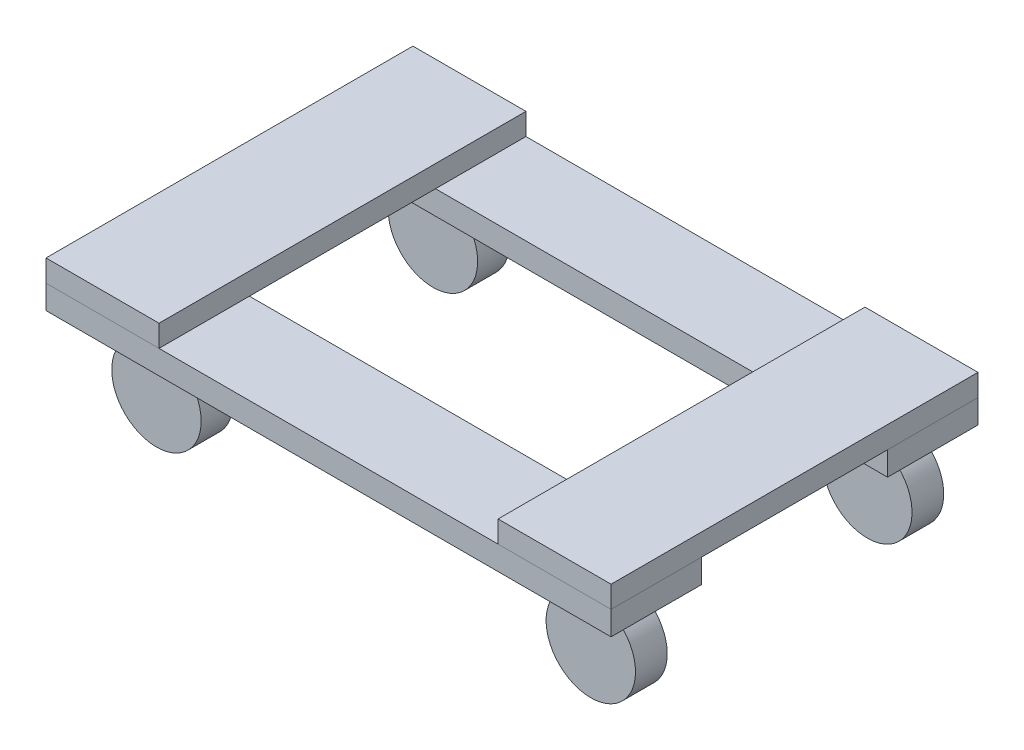
ISO-10303-21;
HEADER;
FILE_DESCRIPTION(('STEP AP214'),'2;1');
FILE_NAME('part.step','',(''),(''),'','','');
FILE_SCHEMA(('AUTOMOTIVE_DESIGN { 1 0 10303 214 1 1 1 1 }'));
ENDSEC;
DATA;
#1=APPLICATION_CONTEXT('core data for automotive mechanical design processes');
#2=APPLICATION_PROTOCOL_DEFINITION('international standard','automotive_design',2000,#1);
#3=PRODUCT_CONTEXT('',#1,'mechanical');
#4=PRODUCT('Part','Part','',(#3));
#5=PRODUCT_RELATED_PRODUCT_CATEGORY('part','',(#4));
#6=PRODUCT_DEFINITION_FORMATION('','',#4);
#7=PRODUCT_DEFINITION_CONTEXT('part definition',#1,'design');
#8=PRODUCT_DEFINITION('design','',#6,#7);
#9=PRODUCT_DEFINITION_SHAPE('','',#8);
#10=(LENGTH_UNIT() NAMED_UNIT(*) SI_UNIT(.MILLI.,.METRE.));
#11=(NAMED_UNIT(*) PLANE_ANGLE_UNIT() SI_UNIT($,.RADIAN.));
#12=(NAMED_UNIT(*) SI_UNIT($,.STERADIAN.) SOLID_ANGLE_UNIT());
#13=UNCERTAINTY_MEASURE_WITH_UNIT(LENGTH_MEASURE(1.E-05),#10,'distance_accuracy_value','');
#14=(GEOMETRIC_REPRESENTATION_CONTEXT(3) GLOBAL_UNCERTAINTY_ASSIGNED_CONTEXT((#13)) GLOBAL_UNIT_ASSIGNED_CONTEXT((#10,
#11,#12)) REPRESENTATION_CONTEXT('',''));
#15=CARTESIAN_POINT('',(0.,0.,0.));
#16=DIRECTION('',(0.,0.,1.));
#17=DIRECTION('',(1.,0.,0.));
#18=AXIS2_PLACEMENT_3D('',#15,#16,#17);
#19=CARTESIAN_POINT('',(412.709416413009,-38.0904165391627,-23.495));
#20=DIRECTION('',(0.,0.,-1.));
#21=DIRECTION('',(-1.,0.,0.));
#22=AXIS2_PLACEMENT_3D('',#19,#20,#21);
#23=CYLINDRICAL_SURFACE('',#22,35.7892438983898);
#24=CARTESIAN_POINT('',(412.709416413009,-38.0904165391627,-23.495));
#25=DIRECTION('',(0.,0.,-1.));
#26=DIRECTION('',(-1.,0.,0.));
#27=AXIS2_PLACEMENT_3D('',#24,#25,#26);
#28=CIRCLE('',#27,35.7892438983898);
#29=CARTESIAN_POINT('',(376.920172514619,-38.0904165391627,-23.495));
#30=VERTEX_POINT('',#29);
#31=EDGE_CURVE('E11',#30,#30,#28,.T.);
#32=ORIENTED_EDGE('',*,*,#31,.T.);
#33=EDGE_LOOP('',(#32));
#34=FACE_BOUND('',#33,.T.);
#35=CARTESIAN_POINT('',(412.709416413009,-38.0904165391627,-48.895));
#36=DIRECTION('',(0.,0.,-1.));
#37=DIRECTION('',(-1.,0.,0.));
#38=AXIS2_PLACEMENT_3D('',#35,#36,#37);
#39=CIRCLE('',#38,35.7892438983898);
#40=CARTESIAN_POINT('',(376.920172514619,-38.0904165391627,-48.895));
#41=VERTEX_POINT('',#40);
#42=EDGE_CURVE('E49',#41,#41,#39,.T.);
#43=ORIENTED_EDGE('',*,*,#42,.F.);
#44=EDGE_LOOP('',(#43));
#45=FACE_BOUND('',#44,.T.);
#46=ADVANCED_FACE('F43',(#34,#45),#23,.T.);
#47=CARTESIAN_POINT('',(412.709416413009,-38.0904165391627,-23.495));
#48=DIRECTION('',(0.,0.,-1.));
#49=DIRECTION('',(-1.,0.,0.));
#50=AXIS2_PLACEMENT_3D('',#47,#48,#49);
#51=PLANE('',#50);
#52=ORIENTED_EDGE('',*,*,#31,.F.);
#53=EDGE_LOOP('',(#52));
#54=FACE_BOUND('',#53,.T.);
#55=ADVANCED_FACE('F58',(#54),#51,.F.);
#56=CARTESIAN_POINT('',(412.709416413009,-38.0904165391627,-48.895));
#57=DIRECTION('',(0.,0.,-1.));
#58=DIRECTION('',(-1.,0.,0.));
#59=AXIS2_PLACEMENT_3D('',#56,#57,#58);
#60=PLANE('',#59);
#61=ORIENTED_EDGE('',*,*,#42,.T.);
#62=EDGE_LOOP('',(#61));
#63=FACE_BOUND('',#62,.T.);
#64=ADVANCED_FACE('F55',(#63),#60,.T.);
#65=CLOSED_SHELL('',(#46,#55,#64));
#66=MANIFOLD_SOLID_BREP('B2',#65);
#67=CARTESIAN_POINT('',(64.9415667025721,-38.0904165391627,-23.495));
#68=DIRECTION('',(0.,0.,-1.));
#69=DIRECTION('',(-1.,0.,0.));
#70=AXIS2_PLACEMENT_3D('',#67,#68,#69);
#71=CYLINDRICAL_SURFACE('',#70,35.7892438983898);
#72=CARTESIAN_POINT('',(64.9415667025721,-38.0904165391627,-23.495));
#73=DIRECTION('',(0.,0.,-1.));
#74=DIRECTION('',(-1.,0.,0.));
#75=AXIS2_PLACEMENT_3D('',#72,#73,#74);
#76=CIRCLE('',#75,35.7892438983898);
#77=CARTESIAN_POINT('',(29.1523228041823,-38.0904165391627,-23.495));
#78=VERTEX_POINT('',#77);
#79=EDGE_CURVE('E42',#78,#78,#76,.T.);
#80=ORIENTED_EDGE('',*,*,#79,.T.);
#81=EDGE_LOOP('',(#80));
#82=FACE_BOUND('',#81,.T.);
#83=CARTESIAN_POINT('',(64.9415667025721,-38.0904165391627,-48.895));
#84=DIRECTION('',(0.,0.,-1.));
#85=DIRECTION('',(-1.,0.,0.));
#86=AXIS2_PLACEMENT_3D('',#83,#84,#85);
#87=CIRCLE('',#86,35.7892438983898);
#88=CARTESIAN_POINT('',(29.1523228041823,-38.0904165391627,-48.895));
#89=VERTEX_POINT('',#88);
#90=EDGE_CURVE('E97',#89,#89,#87,.T.);
#91=ORIENTED_EDGE('',*,*,#90,.F.);
#92=EDGE_LOOP('',(#91));
#93=FACE_BOUND('',#92,.T.);
#94=ADVANCED_FACE('F91',(#82,#93),#71,.T.);
#95=CARTESIAN_POINT('',(64.9415667025721,-38.0904165391627,-23.495));
#96=DIRECTION('',(0.,0.,-1.));
#97=DIRECTION('',(-1.,0.,0.));
#98=AXIS2_PLACEMENT_3D('',#95,#96,#97);
#99=PLANE('',#98);
#100=ORIENTED_EDGE('',*,*,#79,.F.);
#101=EDGE_LOOP('',(#100));
#102=FACE_BOUND('',#101,.T.);
#103=ADVANCED_FACE('F106',(#102),#99,.F.);
#104=CARTESIAN_POINT('',(64.9415667025721,-38.0904165391627,-48.895));
#105=DIRECTION('',(0.,0.,-1.));
#106=DIRECTION('',(-1.,0.,0.));
#107=AXIS2_PLACEMENT_3D('',#104,#105,#106);
#108=PLANE('',#107);
#109=ORIENTED_EDGE('',*,*,#90,.T.);
#110=EDGE_LOOP('',(#109));
#111=FACE_BOUND('',#110,.T.);
#112=ADVANCED_FACE('F103',(#111),#108,.T.);
#113=CLOSED_SHELL('',(#94,#103,#112));
#114=MANIFOLD_SOLID_BREP('B6',#113);
#115=CARTESIAN_POINT('',(412.709416413009,-38.0904165391627,172.496971524493));
#116=DIRECTION('',(0.,0.,1.));
#117=DIRECTION('',(1.,0.,0.));
#118=AXIS2_PLACEMENT_3D('',#115,#116,#117);
#119=CYLINDRICAL_SURFACE('',#118,35.7892438983898);
#120=CARTESIAN_POINT('',(412.709416413009,-38.0904165391627,172.496971524493));
#121=DIRECTION('',(0.,0.,1.));
#122=DIRECTION('',(1.,0.,0.));
#123=AXIS2_PLACEMENT_3D('',#120,#121,#122);
#124=CIRCLE('',#123,35.7892438983898);
#125=CARTESIAN_POINT('',(448.498660311398,-38.0904165391627,172.496971524493));
#126=VERTEX_POINT('',#125);
#127=EDGE_CURVE('E90',#126,#126,#124,.T.);
#128=ORIENTED_EDGE('',*,*,#127,.T.);
#129=EDGE_LOOP('',(#128));
#130=FACE_BOUND('',#129,.T.);
#131=CARTESIAN_POINT('',(412.709416413009,-38.0904165391627,197.896971524493));
#132=DIRECTION('',(0.,0.,1.));
#133=DIRECTION('',(1.,0.,0.));
#134=AXIS2_PLACEMENT_3D('',#131,#132,#133);
#135=CIRCLE('',#134,35.7892438983898);
#136=CARTESIAN_POINT('',(448.498660311398,-38.0904165391627,197.896971524493));
#137=VERTEX_POINT('',#136);
#138=EDGE_CURVE('E146',#137,#137,#135,.T.);
#139=ORIENTED_EDGE('',*,*,#138,.F.);
#140=EDGE_LOOP('',(#139));
#141=FACE_BOUND('',#140,.T.);
#142=ADVANCED_FACE('F139',(#130,#141),#119,.T.);
#143=CARTESIAN_POINT('',(412.709416413009,-38.0904165391627,172.496971524493));
#144=DIRECTION('',(0.,0.,1.));
#145=DIRECTION('',(1.,0.,0.));
#146=AXIS2_PLACEMENT_3D('',#143,#144,#145);
#147=PLANE('',#146);
#148=ORIENTED_EDGE('',*,*,#127,.F.);
#149=EDGE_LOOP('',(#148));
#150=FACE_BOUND('',#149,.T.);
#151=ADVANCED_FACE('F156',(#150),#147,.F.);
#152=CARTESIAN_POINT('',(412.709416413009,-38.0904165391627,197.896971524493));
#153=DIRECTION('',(0.,0.,1.));
#154=DIRECTION('',(1.,0.,0.));
#155=AXIS2_PLACEMENT_3D('',#152,#153,#154);
#156=PLANE('',#155);
#157=ORIENTED_EDGE('',*,*,#138,.T.);
#158=EDGE_LOOP('',(#157));
#159=FACE_BOUND('',#158,.T.);
#160=ADVANCED_FACE('F153',(#159),#156,.T.);
#161=CLOSED_SHELL('',(#142,#151,#160));
#162=MANIFOLD_SOLID_BREP('B37',#161);
#163=CARTESIAN_POINT('',(64.9415667025721,-38.0904165391627,172.496971524493));
#164=DIRECTION('',(0.,0.,1.));
#165=DIRECTION('',(1.,0.,0.));
#166=AXIS2_PLACEMENT_3D('',#163,#164,#165);
#167=CYLINDRICAL_SURFACE('',#166,35.7892438983898);
#168=CARTESIAN_POINT('',(64.9415667025721,-38.0904165391627,172.496971524493));
#169=DIRECTION('',(0.,0.,1.));
#170=DIRECTION('',(1.,0.,0.));
#171=AXIS2_PLACEMENT_3D('',#168,#169,#170);
#172=CIRCLE('',#171,35.7892438983898);
#173=CARTESIAN_POINT('',(100.730810600962,-38.0904165391627,172.496971524493));
#174=VERTEX_POINT('',#173);
#175=EDGE_CURVE('E138',#174,#174,#172,.T.);
#176=ORIENTED_EDGE('',*,*,#175,.T.);
#177=EDGE_LOOP('',(#176));
#178=FACE_BOUND('',#177,.T.);
#179=CARTESIAN_POINT('',(64.9415667025721,-38.0904165391627,197.896971524493));
#180=DIRECTION('',(0.,0.,1.));
#181=DIRECTION('',(1.,0.,0.));
#182=AXIS2_PLACEMENT_3D('',#179,#180,#181);
#183=CIRCLE('',#182,35.7892438983898);
#184=CARTESIAN_POINT('',(100.730810600962,-38.0904165391627,197.896971524493));
#185=VERTEX_POINT('',#184);
#186=EDGE_CURVE('E197',#185,#185,#183,.T.);
#187=ORIENTED_EDGE('',*,*,#186,.F.);
#188=EDGE_LOOP('',(#187));
#189=FACE_BOUND('',#188,.T.);
#190=ADVANCED_FACE('F191',(#178,#189),#167,.T.);
#191=CARTESIAN_POINT('',(64.9415667025721,-38.0904165391627,172.496971524493));
#192=DIRECTION('',(0.,0.,1.));
#193=DIRECTION('',(1.,0.,0.));
#194=AXIS2_PLACEMENT_3D('',#191,#192,#193);
#195=PLANE('',#194);
#196=ORIENTED_EDGE('',*,*,#175,.F.);
#197=EDGE_LOOP('',(#196));
#198=FACE_BOUND('',#197,.T.);
#199=ADVANCED_FACE('F206',(#198),#195,.F.);
#200=CARTESIAN_POINT('',(64.9415667025721,-38.0904165391627,197.896971524493));
#201=DIRECTION('',(0.,0.,1.));
#202=DIRECTION('',(1.,0.,0.));
#203=AXIS2_PLACEMENT_3D('',#200,#201,#202);
#204=PLANE('',#203);
#205=ORIENTED_EDGE('',*,*,#186,.T.);
#206=EDGE_LOOP('',(#205));
#207=FACE_BOUND('',#206,.T.);
#208=ADVANCED_FACE('F203',(#207),#204,.T.);
#209=CLOSED_SHELL('',(#190,#199,#208));
#210=MANIFOLD_SOLID_BREP('B85',#209);
#211=CARTESIAN_POINT('',(0.,36.5125,221.391971524493));
#212=DIRECTION('',(1.,0.,0.));
#213=DIRECTION('',(0.,0.,-1.));
#214=AXIS2_PLACEMENT_3D('',#211,#212,#213);
#215=PLANE('',#214);
#216=DIRECTION('',(0.,0.,1.));
#217=VECTOR('',#216,1.);
#218=CARTESIAN_POINT('',(0.,19.05,221.391971524493));
#219=LINE('',#218,#217);
#220=CARTESIAN_POINT('',(0.,19.05,-72.39));
#221=VERTEX_POINT('',#220);
#222=CARTESIAN_POINT('',(0.,19.05,221.391971524493));
#223=VERTEX_POINT('',#222);
#224=EDGE_CURVE('E304',#221,#223,#219,.T.);
#225=ORIENTED_EDGE('',*,*,#224,.T.);
#226=DIRECTION('',(0.,-1.,0.));
#227=VECTOR('',#226,1.);
#228=CARTESIAN_POINT('',(0.,36.5125,221.391971524493));
#229=LINE('',#228,#227);
#230=CARTESIAN_POINT('',(0.,36.5125,221.391971524493));
#231=VERTEX_POINT('',#230);
#232=EDGE_CURVE('E189',#231,#223,#229,.T.);
#233=ORIENTED_EDGE('',*,*,#232,.F.);
#234=DIRECTION('',(0.,0.,1.));
#235=VECTOR('',#234,1.);
#236=CARTESIAN_POINT('',(0.,36.5125,221.391971524493));
#237=LINE('',#236,#235);
#238=CARTESIAN_POINT('',(0.,36.5125,-72.39));
#239=VERTEX_POINT('',#238);
#240=EDGE_CURVE('E292',#239,#231,#237,.T.);
#241=ORIENTED_EDGE('',*,*,#240,.F.);
#242=DIRECTION('',(0.,-1.,0.));
#243=VECTOR('',#242,1.);
#244=CARTESIAN_POINT('',(0.,36.5125,-72.39));
#245=LINE('',#244,#243);
#246=EDGE_CURVE('E300',#239,#221,#245,.T.);
#247=ORIENTED_EDGE('',*,*,#246,.T.);
#248=EDGE_LOOP('',(#225,#233,#241,#247));
#249=FACE_BOUND('',#248,.T.);
#250=ADVANCED_FACE('F241',(#249),#215,.F.);
#251=CARTESIAN_POINT('',(0.,36.5125,221.391971524493));
#252=DIRECTION('',(0.,0.,-1.));
#253=DIRECTION('',(-1.,0.,0.));
#254=AXIS2_PLACEMENT_3D('',#251,#252,#253);
#255=PLANE('',#254);
#256=DIRECTION('',(1.,0.,0.));
#257=VECTOR('',#256,1.);
#258=CARTESIAN_POINT('',(0.,19.05,221.391971524493));
#259=LINE('',#258,#257);
#260=CARTESIAN_POINT('',(90.4875,19.05,221.391971524493));
#261=VERTEX_POINT('',#260);
#262=EDGE_CURVE('E296',#223,#261,#259,.T.);
#263=ORIENTED_EDGE('',*,*,#262,.T.);
#264=DIRECTION('',(0.,-1.,0.));
#265=VECTOR('',#264,1.);
#266=CARTESIAN_POINT('',(90.4875,36.5125,221.391971524493));
#267=LINE('',#266,#265);
#268=CARTESIAN_POINT('',(90.4875,36.5125,221.391971524493));
#269=VERTEX_POINT('',#268);
#270=EDGE_CURVE('E249',#269,#261,#267,.T.);
#271=ORIENTED_EDGE('',*,*,#270,.F.);
#272=DIRECTION('',(1.,0.,0.));
#273=VECTOR('',#272,1.);
#274=CARTESIAN_POINT('',(0.,36.5125,221.391971524493));
#275=LINE('',#274,#273);
#276=EDGE_CURVE('E287',#231,#269,#275,.T.);
#277=ORIENTED_EDGE('',*,*,#276,.F.);
#278=ORIENTED_EDGE('',*,*,#232,.T.);
#279=EDGE_LOOP('',(#263,#271,#277,#278));
#280=FACE_BOUND('',#279,.T.);
#281=ADVANCED_FACE('F295',(#280),#255,.F.);
#282=CARTESIAN_POINT('',(90.4875,36.5125,221.391971524493));
#283=DIRECTION('',(-1.,0.,0.));
#284=DIRECTION('',(0.,0.,1.));
#285=AXIS2_PLACEMENT_3D('',#282,#283,#284);
#286=PLANE('',#285);
#287=DIRECTION('',(0.,0.,-1.));
#288=VECTOR('',#287,1.);
#289=CARTESIAN_POINT('',(90.4875,19.05,221.391971524493));
#290=LINE('',#289,#288);
#291=CARTESIAN_POINT('',(90.4875,19.05,-72.39));
#292=VERTEX_POINT('',#291);
#293=EDGE_CURVE('E274',#261,#292,#290,.T.);
#294=ORIENTED_EDGE('',*,*,#293,.T.);
#295=DIRECTION('',(0.,-1.,0.));
#296=VECTOR('',#295,1.);
#297=CARTESIAN_POINT('',(90.4875,36.5125,-72.39));
#298=LINE('',#297,#296);
#299=CARTESIAN_POINT('',(90.4875,36.5125,-72.39));
#300=VERTEX_POINT('',#299);
#301=EDGE_CURVE('E297',#300,#292,#298,.T.);
#302=ORIENTED_EDGE('',*,*,#301,.F.);
#303=DIRECTION('',(0.,0.,-1.));
#304=VECTOR('',#303,1.);
#305=CARTESIAN_POINT('',(90.4875,36.5125,221.391971524493));
#306=LINE('',#305,#304);
#307=EDGE_CURVE('E290',#269,#300,#306,.T.);
#308=ORIENTED_EDGE('',*,*,#307,.F.);
#309=ORIENTED_EDGE('',*,*,#270,.T.);
#310=EDGE_LOOP('',(#294,#302,#308,#309));
#311=FACE_BOUND('',#310,.T.);
#312=ADVANCED_FACE('F298',(#311),#286,.F.);
#313=CARTESIAN_POINT('',(0.,36.5125,-72.39));
#314=DIRECTION('',(0.,0.,1.));
#315=DIRECTION('',(1.,0.,0.));
#316=AXIS2_PLACEMENT_3D('',#313,#314,#315);
#317=PLANE('',#316);
#318=DIRECTION('',(-1.,0.,0.));
#319=VECTOR('',#318,1.);
#320=CARTESIAN_POINT('',(0.,19.05,-72.39));
#321=LINE('',#320,#319);
#322=EDGE_CURVE('E280',#292,#221,#321,.T.);
#323=ORIENTED_EDGE('',*,*,#322,.T.);
#324=ORIENTED_EDGE('',*,*,#246,.F.);
#325=DIRECTION('',(-1.,0.,0.));
#326=VECTOR('',#325,1.);
#327=CARTESIAN_POINT('',(0.,36.5125,-72.39));
#328=LINE('',#327,#326);
#329=EDGE_CURVE('E257',#300,#239,#328,.T.);
#330=ORIENTED_EDGE('',*,*,#329,.F.);
#331=ORIENTED_EDGE('',*,*,#301,.T.);
#332=EDGE_LOOP('',(#323,#324,#330,#331));
#333=FACE_BOUND('',#332,.T.);
#334=ADVANCED_FACE('F311',(#333),#317,.F.);
#335=CARTESIAN_POINT('',(0.,36.5125,0.));
#336=DIRECTION('',(0.,-1.,0.));
#337=DIRECTION('',(0.,0.,-1.));
#338=AXIS2_PLACEMENT_3D('',#335,#336,#337);
#339=PLANE('',#338);
#340=ORIENTED_EDGE('',*,*,#240,.T.);
#341=ORIENTED_EDGE('',*,*,#276,.T.);
#342=ORIENTED_EDGE('',*,*,#307,.T.);
#343=ORIENTED_EDGE('',*,*,#329,.T.);
#344=EDGE_LOOP('',(#340,#341,#342,#343));
#345=FACE_BOUND('',#344,.T.);
#346=ADVANCED_FACE('F288',(#345),#339,.F.);
#347=CARTESIAN_POINT('',(0.,19.05,0.));
#348=DIRECTION('',(0.,-1.,0.));
#349=DIRECTION('',(0.,0.,-1.));
#350=AXIS2_PLACEMENT_3D('',#347,#348,#349);
#351=PLANE('',#350);
#352=ORIENTED_EDGE('',*,*,#224,.F.);
#353=ORIENTED_EDGE('',*,*,#322,.F.);
#354=ORIENTED_EDGE('',*,*,#293,.F.);
#355=ORIENTED_EDGE('',*,*,#262,.F.);
#356=EDGE_LOOP('',(#352,#353,#354,#355));
#357=FACE_BOUND('',#356,.T.);
#358=ADVANCED_FACE('F314',(#357),#351,.T.);
#359=CLOSED_SHELL('',(#250,#281,#312,#334,#346,#358));
#360=MANIFOLD_SOLID_BREP('B133',#359);
#361=CARTESIAN_POINT('',(452.4375,36.5125,221.391971524493));
#362=DIRECTION('',(-1.,0.,0.));
#363=DIRECTION('',(0.,0.,1.));
#364=AXIS2_PLACEMENT_3D('',#361,#362,#363);
#365=PLANE('',#364);
#366=DIRECTION('',(0.,0.,-1.));
#367=VECTOR('',#366,1.);
#368=CARTESIAN_POINT('',(452.4375,19.05,221.391971524493));
#369=LINE('',#368,#367);
#370=CARTESIAN_POINT('',(452.4375,19.05,221.391971524493));
#371=VERTEX_POINT('',#370);
#372=CARTESIAN_POINT('',(452.4375,19.05,-72.39));
#373=VERTEX_POINT('',#372);
#374=EDGE_CURVE('E437',#371,#373,#369,.T.);
#375=ORIENTED_EDGE('',*,*,#374,.T.);
#376=DIRECTION('',(0.,-1.,0.));
#377=VECTOR('',#376,1.);
#378=CARTESIAN_POINT('',(452.4375,36.5125,-72.39));
#379=LINE('',#378,#377);
#380=CARTESIAN_POINT('',(452.4375,36.5125,-72.39));
#381=VERTEX_POINT('',#380);
#382=EDGE_CURVE('E239',#381,#373,#379,.T.);
#383=ORIENTED_EDGE('',*,*,#382,.F.);
#384=DIRECTION('',(0.,0.,-1.));
#385=VECTOR('',#384,1.);
#386=CARTESIAN_POINT('',(452.4375,36.5125,221.391971524493));
#387=LINE('',#386,#385);
#388=CARTESIAN_POINT('',(452.4375,36.5125,221.391971524493));
#389=VERTEX_POINT('',#388);
#390=EDGE_CURVE('E425',#389,#381,#387,.T.);
#391=ORIENTED_EDGE('',*,*,#390,.F.);
#392=DIRECTION('',(0.,-1.,0.));
#393=VECTOR('',#392,1.);
#394=CARTESIAN_POINT('',(452.4375,36.5125,221.391971524493));
#395=LINE('',#394,#393);
#396=EDGE_CURVE('E433',#389,#371,#395,.T.);
#397=ORIENTED_EDGE('',*,*,#396,.T.);
#398=EDGE_LOOP('',(#375,#383,#391,#397));
#399=FACE_BOUND('',#398,.T.);
#400=ADVANCED_FACE('F374',(#399),#365,.F.);
#401=CARTESIAN_POINT('',(452.4375,36.5125,-72.39));
#402=DIRECTION('',(0.,0.,1.));
#403=DIRECTION('',(1.,0.,0.));
#404=AXIS2_PLACEMENT_3D('',#401,#402,#403);
#405=PLANE('',#404);
#406=DIRECTION('',(-1.,0.,0.));
#407=VECTOR('',#406,1.);
#408=CARTESIAN_POINT('',(452.4375,19.05,-72.39));
#409=LINE('',#408,#407);
#410=CARTESIAN_POINT('',(361.95,19.05,-72.39));
#411=VERTEX_POINT('',#410);
#412=EDGE_CURVE('E429',#373,#411,#409,.T.);
#413=ORIENTED_EDGE('',*,*,#412,.T.);
#414=DIRECTION('',(0.,-1.,0.));
#415=VECTOR('',#414,1.);
#416=CARTESIAN_POINT('',(361.95,36.5125,-72.39));
#417=LINE('',#416,#415);
#418=CARTESIAN_POINT('',(361.95,36.5125,-72.39));
#419=VERTEX_POINT('',#418);
#420=EDGE_CURVE('E382',#419,#411,#417,.T.);
#421=ORIENTED_EDGE('',*,*,#420,.F.);
#422=DIRECTION('',(-1.,0.,0.));
#423=VECTOR('',#422,1.);
#424=CARTESIAN_POINT('',(452.4375,36.5125,-72.39));
#425=LINE('',#424,#423);
#426=EDGE_CURVE('E420',#381,#419,#425,.T.);
#427=ORIENTED_EDGE('',*,*,#426,.F.);
#428=ORIENTED_EDGE('',*,*,#382,.T.);
#429=EDGE_LOOP('',(#413,#421,#427,#428));
#430=FACE_BOUND('',#429,.T.);
#431=ADVANCED_FACE('F428',(#430),#405,.F.);
#432=CARTESIAN_POINT('',(361.95,36.5125,221.391971524493));
#433=DIRECTION('',(1.,0.,0.));
#434=DIRECTION('',(0.,0.,-1.));
#435=AXIS2_PLACEMENT_3D('',#432,#433,#434);
#436=PLANE('',#435);
#437=DIRECTION('',(0.,0.,1.));
#438=VECTOR('',#437,1.);
#439=CARTESIAN_POINT('',(361.95,19.05,221.391971524493));
#440=LINE('',#439,#438);
#441=CARTESIAN_POINT('',(361.95,19.05,221.391971524493));
#442=VERTEX_POINT('',#441);
#443=EDGE_CURVE('E407',#411,#442,#440,.T.);
#444=ORIENTED_EDGE('',*,*,#443,.T.);
#445=DIRECTION('',(0.,-1.,0.));
#446=VECTOR('',#445,1.);
#447=CARTESIAN_POINT('',(361.95,36.5125,221.391971524493));
#448=LINE('',#447,#446);
#449=CARTESIAN_POINT('',(361.95,36.5125,221.391971524493));
#450=VERTEX_POINT('',#449);
#451=EDGE_CURVE('E430',#450,#442,#448,.T.);
#452=ORIENTED_EDGE('',*,*,#451,.F.);
#453=DIRECTION('',(0.,0.,1.));
#454=VECTOR('',#453,1.);
#455=CARTESIAN_POINT('',(361.95,36.5125,221.391971524493));
#456=LINE('',#455,#454);
#457=EDGE_CURVE('E423',#419,#450,#456,.T.);
#458=ORIENTED_EDGE('',*,*,#457,.F.);
#459=ORIENTED_EDGE('',*,*,#420,.T.);
#460=EDGE_LOOP('',(#444,#452,#458,#459));
#461=FACE_BOUND('',#460,.T.);
#462=ADVANCED_FACE('F431',(#461),#436,.F.);
#463=CARTESIAN_POINT('',(452.4375,36.5125,221.391971524493));
#464=DIRECTION('',(0.,0.,-1.));
#465=DIRECTION('',(-1.,0.,0.));
#466=AXIS2_PLACEMENT_3D('',#463,#464,#465);
#467=PLANE('',#466);
#468=DIRECTION('',(1.,0.,0.));
#469=VECTOR('',#468,1.);
#470=CARTESIAN_POINT('',(452.4375,19.05,221.391971524493));
#471=LINE('',#470,#469);
#472=EDGE_CURVE('E413',#442,#371,#471,.T.);
#473=ORIENTED_EDGE('',*,*,#472,.T.);
#474=ORIENTED_EDGE('',*,*,#396,.F.);
#475=DIRECTION('',(1.,0.,0.));
#476=VECTOR('',#475,1.);
#477=CARTESIAN_POINT('',(452.4375,36.5125,221.391971524493));
#478=LINE('',#477,#476);
#479=EDGE_CURVE('E390',#450,#389,#478,.T.);
#480=ORIENTED_EDGE('',*,*,#479,.F.);
#481=ORIENTED_EDGE('',*,*,#451,.T.);
#482=EDGE_LOOP('',(#473,#474,#480,#481));
#483=FACE_BOUND('',#482,.T.);
#484=ADVANCED_FACE('F445',(#483),#467,.F.);
#485=CARTESIAN_POINT('',(0.,36.5125,0.));
#486=DIRECTION('',(0.,1.,0.));
#487=DIRECTION('',(0.,0.,1.));
#488=AXIS2_PLACEMENT_3D('',#485,#486,#487);
#489=PLANE('',#488);
#490=ORIENTED_EDGE('',*,*,#390,.T.);
#491=ORIENTED_EDGE('',*,*,#426,.T.);
#492=ORIENTED_EDGE('',*,*,#457,.T.);
#493=ORIENTED_EDGE('',*,*,#479,.T.);
#494=EDGE_LOOP('',(#490,#491,#492,#493));
#495=FACE_BOUND('',#494,.T.);
#496=ADVANCED_FACE('F421',(#495),#489,.T.);
#497=CARTESIAN_POINT('',(0.,19.05,0.));
#498=DIRECTION('',(0.,1.,0.));
#499=DIRECTION('',(0.,0.,1.));
#500=AXIS2_PLACEMENT_3D('',#497,#498,#499);
#501=PLANE('',#500);
#502=ORIENTED_EDGE('',*,*,#374,.F.);
#503=ORIENTED_EDGE('',*,*,#472,.F.);
#504=ORIENTED_EDGE('',*,*,#443,.F.);
#505=ORIENTED_EDGE('',*,*,#412,.F.);
#506=EDGE_LOOP('',(#502,#503,#504,#505));
#507=FACE_BOUND('',#506,.T.);
#508=ADVANCED_FACE('F448',(#507),#501,.F.);
#509=CLOSED_SHELL('',(#400,#431,#462,#484,#496,#508));
#510=MANIFOLD_SOLID_BREP('B183',#509);
#511=CARTESIAN_POINT('',(0.,19.05,221.391971524493));
#512=DIRECTION('',(1.,0.,0.));
#513=DIRECTION('',(0.,0.,-1.));
#514=AXIS2_PLACEMENT_3D('',#511,#512,#513);
#515=PLANE('',#514);
#516=DIRECTION('',(0.,0.,1.));
#517=VECTOR('',#516,1.);
#518=CARTESIAN_POINT('',(0.,0.,221.391971524493));
#519=LINE('',#518,#517);
#520=CARTESIAN_POINT('',(0.,0.,149.001971524493));
#521=VERTEX_POINT('',#520);
#522=CARTESIAN_POINT('',(0.,0.,221.391971524493));
#523=VERTEX_POINT('',#522);
#524=EDGE_CURVE('E572',#521,#523,#519,.T.);
#525=ORIENTED_EDGE('',*,*,#524,.T.);
#526=DIRECTION('',(0.,-1.,0.));
#527=VECTOR('',#526,1.);
#528=CARTESIAN_POINT('',(0.,19.05,221.391971524493));
#529=LINE('',#528,#527);
#530=CARTESIAN_POINT('',(0.,19.05,221.391971524493));
#531=VERTEX_POINT('',#530);
#532=EDGE_CURVE('E372',#531,#523,#529,.T.);
#533=ORIENTED_EDGE('',*,*,#532,.F.);
#534=DIRECTION('',(0.,0.,1.));
#535=VECTOR('',#534,1.);
#536=CARTESIAN_POINT('',(0.,19.05,221.391971524493));
#537=LINE('',#536,#535);
#538=CARTESIAN_POINT('',(0.,19.05,149.001971524493));
#539=VERTEX_POINT('',#538);
#540=EDGE_CURVE('E558',#539,#531,#537,.T.);
#541=ORIENTED_EDGE('',*,*,#540,.F.);
#542=DIRECTION('',(0.,-1.,0.));
#543=VECTOR('',#542,1.);
#544=CARTESIAN_POINT('',(0.,19.05,149.001971524493));
#545=LINE('',#544,#543);
#546=EDGE_CURVE('E568',#539,#521,#545,.T.);
#547=ORIENTED_EDGE('',*,*,#546,.T.);
#548=EDGE_LOOP('',(#525,#533,#541,#547));
#549=FACE_BOUND('',#548,.T.);
#550=ADVANCED_FACE('F507',(#549),#515,.F.);
#551=CARTESIAN_POINT('',(0.,19.05,221.391971524493));
#552=DIRECTION('',(0.,0.,-1.));
#553=DIRECTION('',(-1.,0.,0.));
#554=AXIS2_PLACEMENT_3D('',#551,#552,#553);
#555=PLANE('',#554);
#556=DIRECTION('',(1.,0.,0.));
#557=VECTOR('',#556,1.);
#558=CARTESIAN_POINT('',(0.,0.,221.391971524493));
#559=LINE('',#558,#557);
#560=CARTESIAN_POINT('',(452.4375,0.,221.391971524493));
#561=VERTEX_POINT('',#560);
#562=EDGE_CURVE('E563',#523,#561,#559,.T.);
#563=ORIENTED_EDGE('',*,*,#562,.T.);
#564=DIRECTION('',(0.,-1.,0.));
#565=VECTOR('',#564,1.);
#566=CARTESIAN_POINT('',(452.4375,19.05,221.391971524493));
#567=LINE('',#566,#565);
#568=CARTESIAN_POINT('',(452.4375,19.05,221.391971524493));
#569=VERTEX_POINT('',#568);
#570=EDGE_CURVE('E515',#569,#561,#567,.T.);
#571=ORIENTED_EDGE('',*,*,#570,.F.);
#572=DIRECTION('',(1.,0.,0.));
#573=VECTOR('',#572,1.);
#574=CARTESIAN_POINT('',(0.,19.05,221.391971524493));
#575=LINE('',#574,#573);
#576=EDGE_CURVE('E553',#531,#569,#575,.T.);
#577=ORIENTED_EDGE('',*,*,#576,.F.);
#578=ORIENTED_EDGE('',*,*,#532,.T.);
#579=EDGE_LOOP('',(#563,#571,#577,#578));
#580=FACE_BOUND('',#579,.T.);
#581=ADVANCED_FACE('F562',(#580),#555,.F.);
#582=CARTESIAN_POINT('',(452.4375,19.05,221.391971524493));
#583=DIRECTION('',(-1.,0.,0.));
#584=DIRECTION('',(0.,0.,1.));
#585=AXIS2_PLACEMENT_3D('',#582,#583,#584);
#586=PLANE('',#585);
#587=DIRECTION('',(0.,0.,-1.));
#588=VECTOR('',#587,1.);
#589=CARTESIAN_POINT('',(452.4375,0.,221.391971524493));
#590=LINE('',#589,#588);
#591=CARTESIAN_POINT('',(452.4375,0.,149.001971524493));
#592=VERTEX_POINT('',#591);
#593=EDGE_CURVE('E540',#561,#592,#590,.T.);
#594=ORIENTED_EDGE('',*,*,#593,.T.);
#595=DIRECTION('',(0.,-1.,0.));
#596=VECTOR('',#595,1.);
#597=CARTESIAN_POINT('',(452.4375,19.05,149.001971524493));
#598=LINE('',#597,#596);
#599=CARTESIAN_POINT('',(452.4375,19.05,149.001971524493));
#600=VERTEX_POINT('',#599);
#601=EDGE_CURVE('E564',#600,#592,#598,.T.);
#602=ORIENTED_EDGE('',*,*,#601,.F.);
#603=DIRECTION('',(0.,0.,-1.));
#604=VECTOR('',#603,1.);
#605=CARTESIAN_POINT('',(452.4375,19.05,221.391971524493));
#606=LINE('',#605,#604);
#607=EDGE_CURVE('E556',#569,#600,#606,.T.);
#608=ORIENTED_EDGE('',*,*,#607,.F.);
#609=ORIENTED_EDGE('',*,*,#570,.T.);
#610=EDGE_LOOP('',(#594,#602,#608,#609));
#611=FACE_BOUND('',#610,.T.);
#612=ADVANCED_FACE('F565',(#611),#586,.F.);
#613=CARTESIAN_POINT('',(0.,19.05,149.001971524493));
#614=DIRECTION('',(0.,0.,1.));
#615=DIRECTION('',(1.,0.,0.));
#616=AXIS2_PLACEMENT_3D('',#613,#614,#615);
#617=PLANE('',#616);
#618=DIRECTION('',(-1.,0.,0.));
#619=VECTOR('',#618,1.);
#620=CARTESIAN_POINT('',(0.,0.,149.001971524493));
#621=LINE('',#620,#619);
#622=EDGE_CURVE('E546',#592,#521,#621,.T.);
#623=ORIENTED_EDGE('',*,*,#622,.T.);
#624=ORIENTED_EDGE('',*,*,#546,.F.);
#625=DIRECTION('',(-1.,0.,0.));
#626=VECTOR('',#625,1.);
#627=CARTESIAN_POINT('',(0.,19.05,149.001971524493));
#628=LINE('',#627,#626);
#629=EDGE_CURVE('E523',#600,#539,#628,.T.);
#630=ORIENTED_EDGE('',*,*,#629,.F.);
#631=ORIENTED_EDGE('',*,*,#601,.T.);
#632=EDGE_LOOP('',(#623,#624,#630,#631));
#633=FACE_BOUND('',#632,.T.);
#634=ADVANCED_FACE('F581',(#633),#617,.F.);
#635=CARTESIAN_POINT('',(0.,19.05,0.));
#636=DIRECTION('',(0.,-1.,0.));
#637=DIRECTION('',(0.,0.,-1.));
#638=AXIS2_PLACEMENT_3D('',#635,#636,#637);
#639=PLANE('',#638);
#640=ORIENTED_EDGE('',*,*,#540,.T.);
#641=ORIENTED_EDGE('',*,*,#576,.T.);
#642=ORIENTED_EDGE('',*,*,#607,.T.);
#643=ORIENTED_EDGE('',*,*,#629,.T.);
#644=EDGE_LOOP('',(#640,#641,#642,#643));
#645=FACE_BOUND('',#644,.T.);
#646=ADVANCED_FACE('F554',(#645),#639,.F.);
#647=CARTESIAN_POINT('',(0.,0.,0.));
#648=DIRECTION('',(0.,-1.,0.));
#649=DIRECTION('',(0.,0.,-1.));
#650=AXIS2_PLACEMENT_3D('',#647,#648,#649);
#651=PLANE('',#650);
#652=ORIENTED_EDGE('',*,*,#524,.F.);
#653=ORIENTED_EDGE('',*,*,#622,.F.);
#654=ORIENTED_EDGE('',*,*,#593,.F.);
#655=ORIENTED_EDGE('',*,*,#562,.F.);
#656=EDGE_LOOP('',(#652,#653,#654,#655));
#657=FACE_BOUND('',#656,.T.);
#658=ADVANCED_FACE('F584',(#657),#651,.T.);
#659=CLOSED_SHELL('',(#550,#581,#612,#634,#646,#658));
#660=MANIFOLD_SOLID_BREP('B233',#659);
#661=CARTESIAN_POINT('',(0.,19.05,0.));
#662=DIRECTION('',(1.,0.,0.));
#663=DIRECTION('',(0.,0.,-1.));
#664=AXIS2_PLACEMENT_3D('',#661,#662,#663);
#665=PLANE('',#664);
#666=DIRECTION('',(0.,0.,1.));
#667=VECTOR('',#666,1.);
#668=CARTESIAN_POINT('',(0.,0.,0.));
#669=LINE('',#668,#667);
#670=CARTESIAN_POINT('',(0.,0.,-72.39));
#671=VERTEX_POINT('',#670);
#672=CARTESIAN_POINT('',(0.,0.,0.));
#673=VERTEX_POINT('',#672);
#674=EDGE_CURVE('E699',#671,#673,#669,.T.);
#675=ORIENTED_EDGE('',*,*,#674,.T.);
#676=DIRECTION('',(0.,-1.,0.));
#677=VECTOR('',#676,1.);
#678=CARTESIAN_POINT('',(0.,19.05,0.));
#679=LINE('',#678,#677);
#680=CARTESIAN_POINT('',(0.,19.05,0.));
#681=VERTEX_POINT('',#680);
#682=EDGE_CURVE('E505',#681,#673,#679,.T.);
#683=ORIENTED_EDGE('',*,*,#682,.F.);
#684=DIRECTION('',(0.,0.,1.));
#685=VECTOR('',#684,1.);
#686=CARTESIAN_POINT('',(0.,19.05,0.));
#687=LINE('',#686,#685);
#688=CARTESIAN_POINT('',(0.,19.05,-72.39));
#689=VERTEX_POINT('',#688);
#690=EDGE_CURVE('E687',#689,#681,#687,.T.);
#691=ORIENTED_EDGE('',*,*,#690,.F.);
#692=DIRECTION('',(0.,-1.,0.));
#693=VECTOR('',#692,1.);
#694=CARTESIAN_POINT('',(0.,19.05,-72.39));
#695=LINE('',#694,#693);
#696=EDGE_CURVE('E695',#689,#671,#695,.T.);
#697=ORIENTED_EDGE('',*,*,#696,.T.);
#698=EDGE_LOOP('',(#675,#683,#691,#697));
#699=FACE_BOUND('',#698,.T.);
#700=ADVANCED_FACE('F636',(#699),#665,.F.);
#701=CARTESIAN_POINT('',(0.,19.05,0.));
#702=DIRECTION('',(0.,0.,-1.));
#703=DIRECTION('',(-1.,0.,0.));
#704=AXIS2_PLACEMENT_3D('',#701,#702,#703);
#705=PLANE('',#704);
#706=DIRECTION('',(1.,0.,0.));
#707=VECTOR('',#706,1.);
#708=CARTESIAN_POINT('',(0.,0.,0.));
#709=LINE('',#708,#707);
#710=CARTESIAN_POINT('',(452.4375,0.,0.));
#711=VERTEX_POINT('',#710);
#712=EDGE_CURVE('E691',#673,#711,#709,.T.);
#713=ORIENTED_EDGE('',*,*,#712,.T.);
#714=DIRECTION('',(0.,-1.,0.));
#715=VECTOR('',#714,1.);
#716=CARTESIAN_POINT('',(452.4375,19.05,0.));
#717=LINE('',#716,#715);
#718=CARTESIAN_POINT('',(452.4375,19.05,0.));
#719=VERTEX_POINT('',#718);
#720=EDGE_CURVE('E644',#719,#711,#717,.T.);
#721=ORIENTED_EDGE('',*,*,#720,.F.);
#722=DIRECTION('',(1.,0.,0.));
#723=VECTOR('',#722,1.);
#724=CARTESIAN_POINT('',(0.,19.05,0.));
#725=LINE('',#724,#723);
#726=EDGE_CURVE('E682',#681,#719,#725,.T.);
#727=ORIENTED_EDGE('',*,*,#726,.F.);
#728=ORIENTED_EDGE('',*,*,#682,.T.);
#729=EDGE_LOOP('',(#713,#721,#727,#728));
#730=FACE_BOUND('',#729,.T.);
#731=ADVANCED_FACE('F690',(#730),#705,.F.);
#732=CARTESIAN_POINT('',(452.4375,19.05,0.));
#733=DIRECTION('',(-1.,0.,0.));
#734=DIRECTION('',(0.,0.,1.));
#735=AXIS2_PLACEMENT_3D('',#732,#733,#734);
#736=PLANE('',#735);
#737=DIRECTION('',(0.,0.,-1.));
#738=VECTOR('',#737,1.);
#739=CARTESIAN_POINT('',(452.4375,0.,0.));
#740=LINE('',#739,#738);
#741=CARTESIAN_POINT('',(452.4375,0.,-72.39));
#742=VERTEX_POINT('',#741);
#743=EDGE_CURVE('E669',#711,#742,#740,.T.);
#744=ORIENTED_EDGE('',*,*,#743,.T.);
#745=DIRECTION('',(0.,-1.,0.));
#746=VECTOR('',#745,1.);
#747=CARTESIAN_POINT('',(452.4375,19.05,-72.39));
#748=LINE('',#747,#746);
#749=CARTESIAN_POINT('',(452.4375,19.05,-72.39));
#750=VERTEX_POINT('',#749);
#751=EDGE_CURVE('E692',#750,#742,#748,.T.);
#752=ORIENTED_EDGE('',*,*,#751,.F.);
#753=DIRECTION('',(0.,0.,-1.));
#754=VECTOR('',#753,1.);
#755=CARTESIAN_POINT('',(452.4375,19.05,0.));
#756=LINE('',#755,#754);
#757=EDGE_CURVE('E685',#719,#750,#756,.T.);
#758=ORIENTED_EDGE('',*,*,#757,.F.);
#759=ORIENTED_EDGE('',*,*,#720,.T.);
#760=EDGE_LOOP('',(#744,#752,#758,#759));
#761=FACE_BOUND('',#760,.T.);
#762=ADVANCED_FACE('F693',(#761),#736,.F.);
#763=CARTESIAN_POINT('',(0.,19.05,-72.39));
#764=DIRECTION('',(0.,0.,1.));
#765=DIRECTION('',(1.,0.,0.));
#766=AXIS2_PLACEMENT_3D('',#763,#764,#765);
#767=PLANE('',#766);
#768=DIRECTION('',(-1.,0.,0.));
#769=VECTOR('',#768,1.);
#770=CARTESIAN_POINT('',(0.,0.,-72.39));
#771=LINE('',#770,#769);
#772=EDGE_CURVE('E675',#742,#671,#771,.T.);
#773=ORIENTED_EDGE('',*,*,#772,.T.);
#774=ORIENTED_EDGE('',*,*,#696,.F.);
#775=DIRECTION('',(-1.,0.,0.));
#776=VECTOR('',#775,1.);
#777=CARTESIAN_POINT('',(0.,19.05,-72.39));
#778=LINE('',#777,#776);
#779=EDGE_CURVE('E652',#750,#689,#778,.T.);
#780=ORIENTED_EDGE('',*,*,#779,.F.);
#781=ORIENTED_EDGE('',*,*,#751,.T.);
#782=EDGE_LOOP('',(#773,#774,#780,#781));
#783=FACE_BOUND('',#782,.T.);
#784=ADVANCED_FACE('F706',(#783),#767,.F.);
#785=CARTESIAN_POINT('',(0.,19.05,0.));
#786=DIRECTION('',(0.,-1.,0.));
#787=DIRECTION('',(0.,0.,-1.));
#788=AXIS2_PLACEMENT_3D('',#785,#786,#787);
#789=PLANE('',#788);
#790=ORIENTED_EDGE('',*,*,#690,.T.);
#791=ORIENTED_EDGE('',*,*,#726,.T.);
#792=ORIENTED_EDGE('',*,*,#757,.T.);
#793=ORIENTED_EDGE('',*,*,#779,.T.);
#794=EDGE_LOOP('',(#790,#791,#792,#793));
#795=FACE_BOUND('',#794,.T.);
#796=ADVANCED_FACE('F683',(#795),#789,.F.);
#797=CARTESIAN_POINT('',(0.,0.,0.));
#798=DIRECTION('',(0.,-1.,0.));
#799=DIRECTION('',(0.,0.,-1.));
#800=AXIS2_PLACEMENT_3D('',#797,#798,#799);
#801=PLANE('',#800);
#802=ORIENTED_EDGE('',*,*,#674,.F.);
#803=ORIENTED_EDGE('',*,*,#772,.F.);
#804=ORIENTED_EDGE('',*,*,#743,.F.);
#805=ORIENTED_EDGE('',*,*,#712,.F.);
#806=EDGE_LOOP('',(#802,#803,#804,#805));
#807=FACE_BOUND('',#806,.T.);
#808=ADVANCED_FACE('F709',(#807),#801,.T.);
#809=CLOSED_SHELL('',(#700,#731,#762,#784,#796,#808));
#810=MANIFOLD_SOLID_BREP('B366',#809);
#811=ADVANCED_BREP_SHAPE_REPRESENTATION('',(#18,#66,#114,#162,#210,#360,#510,#660,#810),#14);
#812=SHAPE_DEFINITION_REPRESENTATION(#9,#811);
ENDSEC;
END-ISO-10303-21;
